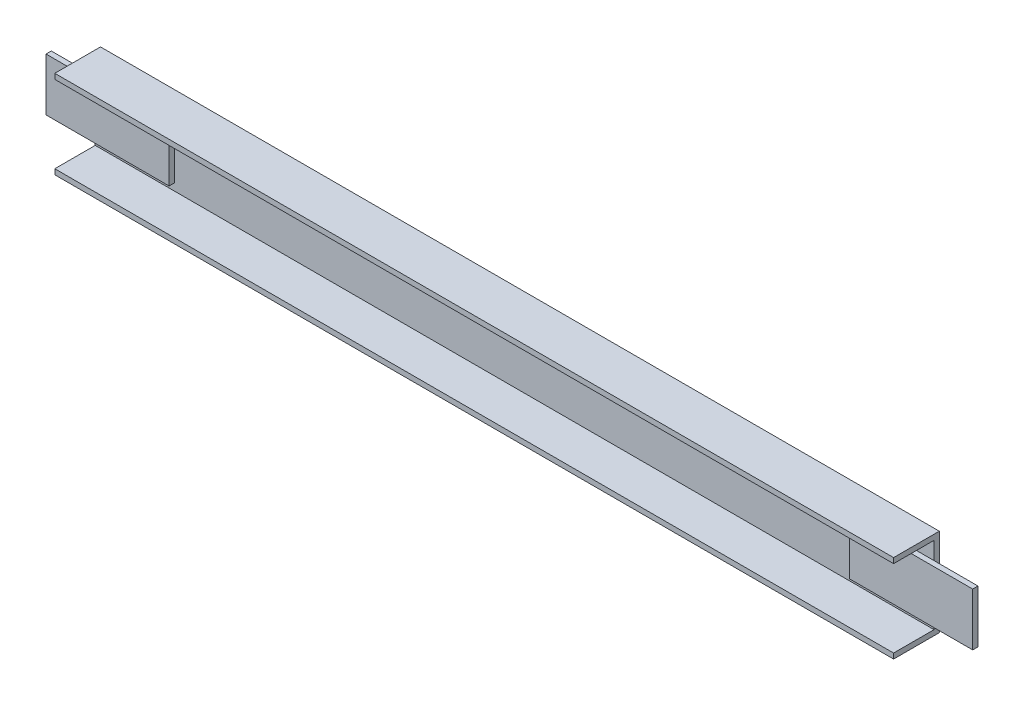
ISO-10303-21;
HEADER;
FILE_DESCRIPTION(('STEP AP214'),'2;1');
FILE_NAME('part.step','',(''),(''),'','','');
FILE_SCHEMA(('AUTOMOTIVE_DESIGN { 1 0 10303 214 1 1 1 1 }'));
ENDSEC;
DATA;
#1=APPLICATION_CONTEXT('core data for automotive mechanical design processes');
#2=APPLICATION_PROTOCOL_DEFINITION('international standard','automotive_design',2000,#1);
#3=PRODUCT_CONTEXT('',#1,'mechanical');
#4=PRODUCT('Part','Part','',(#3));
#5=PRODUCT_RELATED_PRODUCT_CATEGORY('part','',(#4));
#6=PRODUCT_DEFINITION_FORMATION('','',#4);
#7=PRODUCT_DEFINITION_CONTEXT('part definition',#1,'design');
#8=PRODUCT_DEFINITION('design','',#6,#7);
#9=PRODUCT_DEFINITION_SHAPE('','',#8);
#10=(LENGTH_UNIT() NAMED_UNIT(*) SI_UNIT(.MILLI.,.METRE.));
#11=(NAMED_UNIT(*) PLANE_ANGLE_UNIT() SI_UNIT($,.RADIAN.));
#12=(NAMED_UNIT(*) SI_UNIT($,.STERADIAN.) SOLID_ANGLE_UNIT());
#13=UNCERTAINTY_MEASURE_WITH_UNIT(LENGTH_MEASURE(1.E-05),#10,'distance_accuracy_value','');
#14=(GEOMETRIC_REPRESENTATION_CONTEXT(3) GLOBAL_UNCERTAINTY_ASSIGNED_CONTEXT((#13)) GLOBAL_UNIT_ASSIGNED_CONTEXT((#10,
#11,#12)) REPRESENTATION_CONTEXT('',''));
#15=CARTESIAN_POINT('',(0.,0.,0.));
#16=DIRECTION('',(0.,0.,1.));
#17=DIRECTION('',(1.,0.,0.));
#18=AXIS2_PLACEMENT_3D('',#15,#16,#17);
#19=CARTESIAN_POINT('',(0.,0.,488.000005483627));
#20=DIRECTION('',(0.,0.,1.));
#21=DIRECTION('',(1.,0.,0.));
#22=AXIS2_PLACEMENT_3D('',#19,#20,#21);
#23=PLANE('',#22);
#24=DIRECTION('',(0.,-1.,0.));
#25=VECTOR('',#24,1.);
#26=CARTESIAN_POINT('',(-61.0000006854534,170.000001788139,488.000005483627));
#27=LINE('',#26,#25);
#28=CARTESIAN_POINT('',(-61.0000006854534,170.000001788139,488.000005483627));
#29=VERTEX_POINT('',#28);
#30=CARTESIAN_POINT('',(-61.0000006854534,119.999997317791,488.000005483627));
#31=VERTEX_POINT('',#30);
#32=EDGE_CURVE('E271',#29,#31,#27,.T.);
#33=ORIENTED_EDGE('',*,*,#32,.F.);
#34=DIRECTION('',(-1.,0.,0.));
#35=VECTOR('',#34,1.);
#36=CARTESIAN_POINT('',(416.000008583069,170.000001788139,488.000005483627));
#37=LINE('',#36,#35);
#38=CARTESIAN_POINT('',(416.000008583069,170.000001788139,488.000005483627));
#39=VERTEX_POINT('',#38);
#40=EDGE_CURVE('E281',#39,#29,#37,.T.);
#41=ORIENTED_EDGE('',*,*,#40,.F.);
#42=DIRECTION('',(0.,1.,0.));
#43=VECTOR('',#42,1.);
#44=CARTESIAN_POINT('',(416.000008583069,119.999997317791,488.000005483627));
#45=LINE('',#44,#43);
#46=CARTESIAN_POINT('',(416.000008583069,119.999997317791,488.000005483627));
#47=VERTEX_POINT('',#46);
#48=EDGE_CURVE('E278',#47,#39,#45,.T.);
#49=ORIENTED_EDGE('',*,*,#48,.F.);
#50=DIRECTION('',(1.,0.,0.));
#51=VECTOR('',#50,1.);
#52=CARTESIAN_POINT('',(-61.0000006854534,119.999997317791,488.000005483627));
#53=LINE('',#52,#51);
#54=EDGE_CURVE('E274',#31,#47,#53,.T.);
#55=ORIENTED_EDGE('',*,*,#54,.F.);
#56=EDGE_LOOP('',(#33,#41,#49,#55));
#57=FACE_BOUND('',#56,.T.);
#58=DIRECTION('',(1.,0.,0.));
#59=VECTOR('',#58,1.);
#60=CARTESIAN_POINT('',(187.5,155.000001192093,488.000005483627));
#61=LINE('',#60,#59);
#62=CARTESIAN_POINT('',(167.500004172325,155.000001192093,488.000005483627));
#63=VERTEX_POINT('',#62);
#64=CARTESIAN_POINT('',(187.5,155.000001192093,488.000005483627));
#65=VERTEX_POINT('',#64);
#66=EDGE_CURVE('E213',#63,#65,#61,.T.);
#67=ORIENTED_EDGE('',*,*,#66,.F.);
#68=DIRECTION('',(0.,1.,0.));
#69=VECTOR('',#68,1.);
#70=CARTESIAN_POINT('',(167.500004172325,155.000001192093,488.000005483627));
#71=LINE('',#70,#69);
#72=CARTESIAN_POINT('',(167.500004172325,135.000005364418,488.000005483627));
#73=VERTEX_POINT('',#72);
#74=EDGE_CURVE('E128',#73,#63,#71,.T.);
#75=ORIENTED_EDGE('',*,*,#74,.F.);
#76=DIRECTION('',(-1.,0.,0.));
#77=VECTOR('',#76,1.);
#78=CARTESIAN_POINT('',(167.500004172325,135.000005364418,488.000005483627));
#79=LINE('',#78,#77);
#80=CARTESIAN_POINT('',(187.5,135.000005364418,488.000005483627));
#81=VERTEX_POINT('',#80);
#82=EDGE_CURVE('E649',#81,#73,#79,.T.);
#83=ORIENTED_EDGE('',*,*,#82,.F.);
#84=DIRECTION('',(0.,-1.,0.));
#85=VECTOR('',#84,1.);
#86=CARTESIAN_POINT('',(187.5,135.000005364418,488.000005483627));
#87=LINE('',#86,#85);
#88=EDGE_CURVE('E57',#65,#81,#87,.T.);
#89=ORIENTED_EDGE('',*,*,#88,.F.);
#90=EDGE_LOOP('',(#67,#75,#83,#89));
#91=FACE_BOUND('',#90,.T.);
#92=ADVANCED_FACE('F38',(#57,#91),#23,.F.);
#93=CARTESIAN_POINT('',(416.000008583069,166.999995708466,490.99999666214));
#94=DIRECTION('',(0.,0.,-1.));
#95=DIRECTION('',(-1.,0.,0.));
#96=AXIS2_PLACEMENT_3D('',#93,#94,#95);
#97=PLANE('',#96);
#98=DIRECTION('',(1.,0.,0.));
#99=VECTOR('',#98,1.);
#100=CARTESIAN_POINT('',(416.000008583069,126.999995231628,490.99999666214));
#101=LINE('',#100,#99);
#102=CARTESIAN_POINT('',(-61.0000006854534,126.999995231628,490.99999666214));
#103=VERTEX_POINT('',#102);
#104=CARTESIAN_POINT('',(-16.0000007599592,126.999995231628,490.99999666214));
#105=VERTEX_POINT('',#104);
#106=EDGE_CURVE('E42',#103,#105,#101,.T.);
#107=ORIENTED_EDGE('',*,*,#106,.F.);
#108=DIRECTION('',(0.,-1.,0.));
#109=VECTOR('',#108,1.);
#110=CARTESIAN_POINT('',(-61.0000006854534,166.999995708466,490.99999666214));
#111=LINE('',#110,#109);
#112=CARTESIAN_POINT('',(-61.0000006854534,123.000003397465,490.99999666214));
#113=VERTEX_POINT('',#112);
#114=EDGE_CURVE('E257',#103,#113,#111,.T.);
#115=ORIENTED_EDGE('',*,*,#114,.T.);
#116=DIRECTION('',(-1.,0.,0.));
#117=VECTOR('',#116,1.);
#118=CARTESIAN_POINT('',(416.000008583069,123.000003397465,490.99999666214));
#119=LINE('',#118,#117);
#120=CARTESIAN_POINT('',(416.000008583069,123.000003397465,490.99999666214));
#121=VERTEX_POINT('',#120);
#122=EDGE_CURVE('E261',#121,#113,#119,.T.);
#123=ORIENTED_EDGE('',*,*,#122,.F.);
#124=DIRECTION('',(0.,-1.,0.));
#125=VECTOR('',#124,1.);
#126=CARTESIAN_POINT('',(416.000008583069,166.999995708466,490.99999666214));
#127=LINE('',#126,#125);
#128=CARTESIAN_POINT('',(416.000008583069,126.999995231628,490.99999666214));
#129=VERTEX_POINT('',#128);
#130=EDGE_CURVE('E245',#129,#121,#127,.T.);
#131=ORIENTED_EDGE('',*,*,#130,.F.);
#132=DIRECTION('',(1.,0.,0.));
#133=VECTOR('',#132,1.);
#134=CARTESIAN_POINT('',(416.000008583069,126.999995231628,490.99999666214));
#135=LINE('',#134,#133);
#136=CARTESIAN_POINT('',(370.999991893768,126.999995231628,490.99999666214));
#137=VERTEX_POINT('',#136);
#138=EDGE_CURVE('E311',#137,#129,#135,.T.);
#139=ORIENTED_EDGE('',*,*,#138,.F.);
#140=DIRECTION('',(0.,-1.,0.));
#141=VECTOR('',#140,1.);
#142=CARTESIAN_POINT('',(370.999991893768,129.999995231628,490.99999666214));
#143=LINE('',#142,#141);
#144=CARTESIAN_POINT('',(370.999991893768,156.999996423721,490.99999666214));
#145=VERTEX_POINT('',#144);
#146=EDGE_CURVE('E233',#145,#137,#143,.T.);
#147=ORIENTED_EDGE('',*,*,#146,.F.);
#148=DIRECTION('',(-1.,0.,0.));
#149=VECTOR('',#148,1.);
#150=CARTESIAN_POINT('',(416.000008583069,156.999996423721,490.99999666214));
#151=LINE('',#150,#149);
#152=CARTESIAN_POINT('',(416.000008583069,156.999996423721,490.99999666214));
#153=VERTEX_POINT('',#152);
#154=EDGE_CURVE('E12',#153,#145,#151,.T.);
#155=ORIENTED_EDGE('',*,*,#154,.F.);
#156=CARTESIAN_POINT('',(416.000008583069,166.999995708466,490.99999666214));
#157=VERTEX_POINT('',#156);
#158=EDGE_CURVE('E246',#157,#153,#127,.T.);
#159=ORIENTED_EDGE('',*,*,#158,.F.);
#160=DIRECTION('',(-1.,0.,0.));
#161=VECTOR('',#160,1.);
#162=CARTESIAN_POINT('',(416.000008583069,166.999995708466,490.99999666214));
#163=LINE('',#162,#161);
#164=CARTESIAN_POINT('',(-61.0000006854534,166.999995708466,490.99999666214));
#165=VERTEX_POINT('',#164);
#166=EDGE_CURVE('E265',#157,#165,#163,.T.);
#167=ORIENTED_EDGE('',*,*,#166,.T.);
#168=CARTESIAN_POINT('',(-61.0000006854534,156.999996423721,490.99999666214));
#169=VERTEX_POINT('',#168);
#170=EDGE_CURVE('E242',#165,#169,#111,.T.);
#171=ORIENTED_EDGE('',*,*,#170,.T.);
#172=DIRECTION('',(-1.,0.,0.));
#173=VECTOR('',#172,1.);
#174=CARTESIAN_POINT('',(416.000008583069,156.999996423721,490.99999666214));
#175=LINE('',#174,#173);
#176=CARTESIAN_POINT('',(-16.0000007599592,156.999996423721,490.99999666214));
#177=VERTEX_POINT('',#176);
#178=EDGE_CURVE('E308',#177,#169,#175,.T.);
#179=ORIENTED_EDGE('',*,*,#178,.F.);
#180=DIRECTION('',(0.,1.,0.));
#181=VECTOR('',#180,1.);
#182=CARTESIAN_POINT('',(-16.0000007599592,159.999996423721,490.99999666214));
#183=LINE('',#182,#181);
#184=EDGE_CURVE('E124',#105,#177,#183,.T.);
#185=ORIENTED_EDGE('',*,*,#184,.F.);
#186=EDGE_LOOP('',(#107,#115,#123,#131,#139,#147,#155,#159,#167,#171,#179,#185));
#187=FACE_BOUND('',#186,.T.);
#188=ADVANCED_FACE('F357',(#187),#97,.F.);
#189=CARTESIAN_POINT('',(0.,0.,513.999998569489));
#190=DIRECTION('',(0.,0.,1.));
#191=DIRECTION('',(1.,0.,0.));
#192=AXIS2_PLACEMENT_3D('',#189,#190,#191);
#193=PLANE('',#192);
#194=DIRECTION('',(-1.,0.,0.));
#195=VECTOR('',#194,1.);
#196=CARTESIAN_POINT('',(416.000008583069,123.000003397465,513.999998569489));
#197=LINE('',#196,#195);
#198=CARTESIAN_POINT('',(416.000008583069,123.000003397465,513.999998569489));
#199=VERTEX_POINT('',#198);
#200=CARTESIAN_POINT('',(-61.0000006854534,123.000003397465,513.999998569489));
#201=VERTEX_POINT('',#200);
#202=EDGE_CURVE('E249',#199,#201,#197,.T.);
#203=ORIENTED_EDGE('',*,*,#202,.T.);
#204=DIRECTION('',(0.,-1.,0.));
#205=VECTOR('',#204,1.);
#206=CARTESIAN_POINT('',(-61.0000006854534,170.000001788139,513.999998569489));
#207=LINE('',#206,#205);
#208=CARTESIAN_POINT('',(-61.0000006854534,119.999997317791,513.999998569489));
#209=VERTEX_POINT('',#208);
#210=EDGE_CURVE('E264',#201,#209,#207,.T.);
#211=ORIENTED_EDGE('',*,*,#210,.T.);
#212=DIRECTION('',(1.,0.,0.));
#213=VECTOR('',#212,1.);
#214=CARTESIAN_POINT('',(-61.0000006854534,119.999997317791,513.999998569489));
#215=LINE('',#214,#213);
#216=CARTESIAN_POINT('',(416.000008583069,119.999997317791,513.999998569489));
#217=VERTEX_POINT('',#216);
#218=EDGE_CURVE('E288',#209,#217,#215,.T.);
#219=ORIENTED_EDGE('',*,*,#218,.T.);
#220=DIRECTION('',(0.,1.,0.));
#221=VECTOR('',#220,1.);
#222=CARTESIAN_POINT('',(416.000008583069,119.999997317791,513.999998569489));
#223=LINE('',#222,#221);
#224=EDGE_CURVE('E292',#217,#199,#223,.T.);
#225=ORIENTED_EDGE('',*,*,#224,.T.);
#226=EDGE_LOOP('',(#203,#211,#219,#225));
#227=FACE_BOUND('',#226,.T.);
#228=ADVANCED_FACE('F391',(#227),#193,.T.);
#229=CARTESIAN_POINT('',(-61.0000006854534,170.000001788139,488.000005483627));
#230=DIRECTION('',(-1.,0.,0.));
#231=DIRECTION('',(0.,0.,1.));
#232=AXIS2_PLACEMENT_3D('',#229,#230,#231);
#233=PLANE('',#232);
#234=DIRECTION('',(0.,0.,1.));
#235=VECTOR('',#234,1.);
#236=CARTESIAN_POINT('',(-61.0000006854534,123.000003397465,490.99999666214));
#237=LINE('',#236,#235);
#238=EDGE_CURVE('E251',#113,#201,#237,.T.);
#239=ORIENTED_EDGE('',*,*,#238,.F.);
#240=ORIENTED_EDGE('',*,*,#114,.F.);
#241=EDGE_CURVE('E260',#169,#103,#111,.T.);
#242=ORIENTED_EDGE('',*,*,#241,.F.);
#243=ORIENTED_EDGE('',*,*,#170,.F.);
#244=DIRECTION('',(0.,0.,-1.));
#245=VECTOR('',#244,1.);
#246=CARTESIAN_POINT('',(-61.0000006854534,166.999995708466,513.999998569489));
#247=LINE('',#246,#245);
#248=CARTESIAN_POINT('',(-61.0000006854534,166.999995708466,513.999998569489));
#249=VERTEX_POINT('',#248);
#250=EDGE_CURVE('E253',#249,#165,#247,.T.);
#251=ORIENTED_EDGE('',*,*,#250,.F.);
#252=CARTESIAN_POINT('',(-61.0000006854534,170.000001788139,513.999998569489));
#253=VERTEX_POINT('',#252);
#254=EDGE_CURVE('E285',#253,#249,#207,.T.);
#255=ORIENTED_EDGE('',*,*,#254,.F.);
#256=DIRECTION('',(0.,0.,1.));
#257=VECTOR('',#256,1.);
#258=CARTESIAN_POINT('',(-61.0000006854534,170.000001788139,488.000005483627));
#259=LINE('',#258,#257);
#260=EDGE_CURVE('E48',#29,#253,#259,.T.);
#261=ORIENTED_EDGE('',*,*,#260,.F.);
#262=ORIENTED_EDGE('',*,*,#32,.T.);
#263=DIRECTION('',(0.,0.,1.));
#264=VECTOR('',#263,1.);
#265=CARTESIAN_POINT('',(-61.0000006854534,119.999997317791,488.000005483627));
#266=LINE('',#265,#264);
#267=EDGE_CURVE('E284',#31,#209,#266,.T.);
#268=ORIENTED_EDGE('',*,*,#267,.T.);
#269=ORIENTED_EDGE('',*,*,#210,.F.);
#270=EDGE_LOOP('',(#239,#240,#242,#243,#251,#255,#261,#262,#268,#269));
#271=FACE_BOUND('',#270,.T.);
#272=ADVANCED_FACE('F367',(#271),#233,.T.);
#273=CARTESIAN_POINT('',(416.000008583069,170.000001788139,488.000005483627));
#274=DIRECTION('',(0.,1.,0.));
#275=DIRECTION('',(0.,0.,1.));
#276=AXIS2_PLACEMENT_3D('',#273,#274,#275);
#277=PLANE('',#276);
#278=DIRECTION('',(-1.,0.,0.));
#279=VECTOR('',#278,1.);
#280=CARTESIAN_POINT('',(416.000008583069,170.000001788139,513.999998569489));
#281=LINE('',#280,#279);
#282=CARTESIAN_POINT('',(416.000008583069,170.000001788139,513.999998569489));
#283=VERTEX_POINT('',#282);
#284=EDGE_CURVE('E275',#283,#253,#281,.T.);
#285=ORIENTED_EDGE('',*,*,#284,.F.);
#286=DIRECTION('',(0.,0.,1.));
#287=VECTOR('',#286,1.);
#288=CARTESIAN_POINT('',(416.000008583069,170.000001788139,488.000005483627));
#289=LINE('',#288,#287);
#290=EDGE_CURVE('E298',#39,#283,#289,.T.);
#291=ORIENTED_EDGE('',*,*,#290,.F.);
#292=ORIENTED_EDGE('',*,*,#40,.T.);
#293=ORIENTED_EDGE('',*,*,#260,.T.);
#294=EDGE_LOOP('',(#285,#291,#292,#293));
#295=FACE_BOUND('',#294,.T.);
#296=ADVANCED_FACE('F379',(#295),#277,.T.);
#297=CARTESIAN_POINT('',(416.000008583069,119.999997317791,488.000005483627));
#298=DIRECTION('',(1.,0.,0.));
#299=DIRECTION('',(0.,0.,-1.));
#300=AXIS2_PLACEMENT_3D('',#297,#298,#299);
#301=PLANE('',#300);
#302=DIRECTION('',(0.,0.,1.));
#303=VECTOR('',#302,1.);
#304=CARTESIAN_POINT('',(416.000008583069,123.000003397465,490.99999666214));
#305=LINE('',#304,#303);
#306=EDGE_CURVE('E238',#121,#199,#305,.T.);
#307=ORIENTED_EDGE('',*,*,#306,.T.);
#308=ORIENTED_EDGE('',*,*,#224,.F.);
#309=DIRECTION('',(0.,0.,1.));
#310=VECTOR('',#309,1.);
#311=CARTESIAN_POINT('',(416.000008583069,119.999997317791,488.000005483627));
#312=LINE('',#311,#310);
#313=EDGE_CURVE('E301',#47,#217,#312,.T.);
#314=ORIENTED_EDGE('',*,*,#313,.F.);
#315=ORIENTED_EDGE('',*,*,#48,.T.);
#316=ORIENTED_EDGE('',*,*,#290,.T.);
#317=CARTESIAN_POINT('',(416.000008583069,166.999995708466,513.999998569489));
#318=VERTEX_POINT('',#317);
#319=EDGE_CURVE('E291',#318,#283,#223,.T.);
#320=ORIENTED_EDGE('',*,*,#319,.F.);
#321=DIRECTION('',(0.,0.,-1.));
#322=VECTOR('',#321,1.);
#323=CARTESIAN_POINT('',(416.000008583069,166.999995708466,513.999998569489));
#324=LINE('',#323,#322);
#325=EDGE_CURVE('E241',#318,#157,#324,.T.);
#326=ORIENTED_EDGE('',*,*,#325,.T.);
#327=ORIENTED_EDGE('',*,*,#158,.T.);
#328=EDGE_CURVE('E250',#153,#129,#127,.T.);
#329=ORIENTED_EDGE('',*,*,#328,.T.);
#330=ORIENTED_EDGE('',*,*,#130,.T.);
#331=EDGE_LOOP('',(#307,#308,#314,#315,#316,#320,#326,#327,#329,#330));
#332=FACE_BOUND('',#331,.T.);
#333=ADVANCED_FACE('F396',(#332),#301,.T.);
#334=CARTESIAN_POINT('',(-61.0000006854534,119.999997317791,488.000005483627));
#335=DIRECTION('',(0.,-1.,0.));
#336=DIRECTION('',(0.,0.,-1.));
#337=AXIS2_PLACEMENT_3D('',#334,#335,#336);
#338=PLANE('',#337);
#339=ORIENTED_EDGE('',*,*,#218,.F.);
#340=ORIENTED_EDGE('',*,*,#267,.F.);
#341=ORIENTED_EDGE('',*,*,#54,.T.);
#342=ORIENTED_EDGE('',*,*,#313,.T.);
#343=EDGE_LOOP('',(#339,#340,#341,#342));
#344=FACE_BOUND('',#343,.T.);
#345=ADVANCED_FACE('F387',(#344),#338,.T.);
#346=DIRECTION('',(-1.,0.,0.));
#347=VECTOR('',#346,1.);
#348=CARTESIAN_POINT('',(416.000008583069,166.999995708466,513.999998569489));
#349=LINE('',#348,#347);
#350=EDGE_CURVE('E267',#318,#249,#349,.T.);
#351=ORIENTED_EDGE('',*,*,#350,.F.);
#352=ORIENTED_EDGE('',*,*,#319,.T.);
#353=ORIENTED_EDGE('',*,*,#284,.T.);
#354=ORIENTED_EDGE('',*,*,#254,.T.);
#355=EDGE_LOOP('',(#351,#352,#353,#354));
#356=FACE_BOUND('',#355,.T.);
#357=ADVANCED_FACE('F375',(#356),#193,.T.);
#358=CARTESIAN_POINT('',(416.000008583069,123.000003397465,490.99999666214));
#359=DIRECTION('',(0.,-1.,0.));
#360=DIRECTION('',(0.,0.,-1.));
#361=AXIS2_PLACEMENT_3D('',#358,#359,#360);
#362=PLANE('',#361);
#363=ORIENTED_EDGE('',*,*,#238,.T.);
#364=ORIENTED_EDGE('',*,*,#202,.F.);
#365=ORIENTED_EDGE('',*,*,#306,.F.);
#366=ORIENTED_EDGE('',*,*,#122,.T.);
#367=EDGE_LOOP('',(#363,#364,#365,#366));
#368=FACE_BOUND('',#367,.T.);
#369=ADVANCED_FACE('F394',(#368),#362,.F.);
#370=CARTESIAN_POINT('',(416.000008583069,166.999995708466,513.999998569489));
#371=DIRECTION('',(0.,1.,0.));
#372=DIRECTION('',(0.,0.,1.));
#373=AXIS2_PLACEMENT_3D('',#370,#371,#372);
#374=PLANE('',#373);
#375=ORIENTED_EDGE('',*,*,#250,.T.);
#376=ORIENTED_EDGE('',*,*,#166,.F.);
#377=ORIENTED_EDGE('',*,*,#325,.F.);
#378=ORIENTED_EDGE('',*,*,#350,.T.);
#379=EDGE_LOOP('',(#375,#376,#377,#378));
#380=FACE_BOUND('',#379,.T.);
#381=ADVANCED_FACE('F371',(#380),#374,.F.);
#382=CARTESIAN_POINT('',(470.999985933304,126.999995231628,493.999987840652));
#383=DIRECTION('',(0.,1.,0.));
#384=DIRECTION('',(0.,0.,1.));
#385=AXIS2_PLACEMENT_3D('',#382,#383,#384);
#386=PLANE('',#385);
#387=ORIENTED_EDGE('',*,*,#138,.T.);
#388=DIRECTION('',(1.,0.,0.));
#389=VECTOR('',#388,1.);
#390=CARTESIAN_POINT('',(0.,126.999995231628,490.99999666214));
#391=LINE('',#390,#389);
#392=CARTESIAN_POINT('',(440.999985933304,126.999995231628,490.99999666214));
#393=VERTEX_POINT('',#392);
#394=EDGE_CURVE('E336',#129,#393,#391,.T.);
#395=ORIENTED_EDGE('',*,*,#394,.T.);
#396=DIRECTION('',(0.,0.,-1.));
#397=VECTOR('',#396,1.);
#398=CARTESIAN_POINT('',(440.999985933304,126.999995231628,493.999987840652));
#399=LINE('',#398,#397);
#400=CARTESIAN_POINT('',(440.999985933304,126.999995231628,493.999987840652));
#401=VERTEX_POINT('',#400);
#402=EDGE_CURVE('E254',#401,#393,#399,.T.);
#403=ORIENTED_EDGE('',*,*,#402,.F.);
#404=DIRECTION('',(1.,0.,0.));
#405=VECTOR('',#404,1.);
#406=CARTESIAN_POINT('',(0.,126.999995231628,493.999987840652));
#407=LINE('',#406,#405);
#408=CARTESIAN_POINT('',(370.999991893768,126.999995231628,493.999987840652));
#409=VERTEX_POINT('',#408);
#410=EDGE_CURVE('E236',#409,#401,#407,.T.);
#411=ORIENTED_EDGE('',*,*,#410,.F.);
#412=DIRECTION('',(0.,0.,-1.));
#413=VECTOR('',#412,1.);
#414=CARTESIAN_POINT('',(370.999991893768,126.999995231628,493.999987840652));
#415=LINE('',#414,#413);
#416=EDGE_CURVE('E231',#409,#137,#415,.T.);
#417=ORIENTED_EDGE('',*,*,#416,.T.);
#418=EDGE_LOOP('',(#387,#395,#403,#411,#417));
#419=FACE_BOUND('',#418,.T.);
#420=ADVANCED_FACE('F407',(#419),#386,.F.);
#421=CARTESIAN_POINT('',(440.999985933304,159.999996423721,493.999987840652));
#422=DIRECTION('',(-1.,0.,0.));
#423=DIRECTION('',(0.,0.,1.));
#424=AXIS2_PLACEMENT_3D('',#421,#422,#423);
#425=PLANE('',#424);
#426=DIRECTION('',(0.,1.,0.));
#427=VECTOR('',#426,1.);
#428=CARTESIAN_POINT('',(440.999985933304,0.,490.99999666214));
#429=LINE('',#428,#427);
#430=CARTESIAN_POINT('',(440.999985933304,156.999996423721,490.99999666214));
#431=VERTEX_POINT('',#430);
#432=EDGE_CURVE('E309',#393,#431,#429,.T.);
#433=ORIENTED_EDGE('',*,*,#432,.T.);
#434=DIRECTION('',(0.,0.,-1.));
#435=VECTOR('',#434,1.);
#436=CARTESIAN_POINT('',(440.999985933304,156.999996423721,493.999987840652));
#437=LINE('',#436,#435);
#438=CARTESIAN_POINT('',(440.999985933304,156.999996423721,493.999987840652));
#439=VERTEX_POINT('',#438);
#440=EDGE_CURVE('E327',#439,#431,#437,.T.);
#441=ORIENTED_EDGE('',*,*,#440,.F.);
#442=DIRECTION('',(0.,1.,0.));
#443=VECTOR('',#442,1.);
#444=CARTESIAN_POINT('',(440.999985933304,0.,493.999987840652));
#445=LINE('',#444,#443);
#446=EDGE_CURVE('E312',#401,#439,#445,.T.);
#447=ORIENTED_EDGE('',*,*,#446,.F.);
#448=ORIENTED_EDGE('',*,*,#402,.T.);
#449=EDGE_LOOP('',(#433,#441,#447,#448));
#450=FACE_BOUND('',#449,.T.);
#451=ADVANCED_FACE('F420',(#450),#425,.F.);
#452=CARTESIAN_POINT('',(370.999991893768,156.999996423721,493.999987840652));
#453=DIRECTION('',(0.,-1.,0.));
#454=DIRECTION('',(0.,0.,-1.));
#455=AXIS2_PLACEMENT_3D('',#452,#453,#454);
#456=PLANE('',#455);
#457=DIRECTION('',(-1.,0.,0.));
#458=VECTOR('',#457,1.);
#459=CARTESIAN_POINT('',(0.,156.999996423721,490.99999666214));
#460=LINE('',#459,#458);
#461=EDGE_CURVE('E237',#431,#153,#460,.T.);
#462=ORIENTED_EDGE('',*,*,#461,.T.);
#463=ORIENTED_EDGE('',*,*,#154,.T.);
#464=DIRECTION('',(0.,0.,-1.));
#465=VECTOR('',#464,1.);
#466=CARTESIAN_POINT('',(370.999991893768,156.999996423721,493.999987840652));
#467=LINE('',#466,#465);
#468=CARTESIAN_POINT('',(370.999991893768,156.999996423721,493.999987840652));
#469=VERTEX_POINT('',#468);
#470=EDGE_CURVE('E330',#469,#145,#467,.T.);
#471=ORIENTED_EDGE('',*,*,#470,.F.);
#472=DIRECTION('',(-1.,0.,0.));
#473=VECTOR('',#472,1.);
#474=CARTESIAN_POINT('',(0.,156.999996423721,493.999987840652));
#475=LINE('',#474,#473);
#476=EDGE_CURVE('E232',#439,#469,#475,.T.);
#477=ORIENTED_EDGE('',*,*,#476,.F.);
#478=ORIENTED_EDGE('',*,*,#440,.T.);
#479=EDGE_LOOP('',(#462,#463,#471,#477,#478));
#480=FACE_BOUND('',#479,.T.);
#481=ADVANCED_FACE('F414',(#480),#456,.F.);
#482=CARTESIAN_POINT('',(370.999991893768,129.999995231628,493.999987840652));
#483=DIRECTION('',(1.,0.,0.));
#484=DIRECTION('',(0.,0.,-1.));
#485=AXIS2_PLACEMENT_3D('',#482,#483,#484);
#486=PLANE('',#485);
#487=ORIENTED_EDGE('',*,*,#146,.T.);
#488=ORIENTED_EDGE('',*,*,#416,.F.);
#489=DIRECTION('',(0.,-1.,0.));
#490=VECTOR('',#489,1.);
#491=CARTESIAN_POINT('',(370.999991893768,129.999995231628,493.999987840652));
#492=LINE('',#491,#490);
#493=EDGE_CURVE('E229',#469,#409,#492,.T.);
#494=ORIENTED_EDGE('',*,*,#493,.F.);
#495=ORIENTED_EDGE('',*,*,#470,.T.);
#496=EDGE_LOOP('',(#487,#488,#494,#495));
#497=FACE_BOUND('',#496,.T.);
#498=ADVANCED_FACE('F403',(#497),#486,.F.);
#499=CARTESIAN_POINT('',(0.,0.,493.999987840652));
#500=DIRECTION('',(0.,0.,-1.));
#501=DIRECTION('',(-1.,0.,0.));
#502=AXIS2_PLACEMENT_3D('',#499,#500,#501);
#503=PLANE('',#502);
#504=ORIENTED_EDGE('',*,*,#410,.T.);
#505=ORIENTED_EDGE('',*,*,#446,.T.);
#506=ORIENTED_EDGE('',*,*,#476,.T.);
#507=ORIENTED_EDGE('',*,*,#493,.T.);
#508=EDGE_LOOP('',(#504,#505,#506,#507));
#509=FACE_BOUND('',#508,.T.);
#510=ADVANCED_FACE('F410',(#509),#503,.F.);
#511=CARTESIAN_POINT('',(0.,0.,490.99999666214));
#512=DIRECTION('',(0.,0.,-1.));
#513=DIRECTION('',(-1.,0.,0.));
#514=AXIS2_PLACEMENT_3D('',#511,#512,#513);
#515=PLANE('',#514);
#516=ORIENTED_EDGE('',*,*,#394,.F.);
#517=ORIENTED_EDGE('',*,*,#328,.F.);
#518=ORIENTED_EDGE('',*,*,#461,.F.);
#519=ORIENTED_EDGE('',*,*,#432,.F.);
#520=EDGE_LOOP('',(#516,#517,#518,#519));
#521=FACE_BOUND('',#520,.T.);
#522=ADVANCED_FACE('F417',(#521),#515,.T.);
#523=CARTESIAN_POINT('',(-85.9999966621399,129.999995231628,493.999987840652));
#524=DIRECTION('',(1.,0.,0.));
#525=DIRECTION('',(0.,0.,-1.));
#526=AXIS2_PLACEMENT_3D('',#523,#524,#525);
#527=PLANE('',#526);
#528=DIRECTION('',(0.,-1.,0.));
#529=VECTOR('',#528,1.);
#530=CARTESIAN_POINT('',(-85.9999966621399,0.,490.99999666214));
#531=LINE('',#530,#529);
#532=CARTESIAN_POINT('',(-85.9999966621399,156.999996423721,490.99999666214));
#533=VERTEX_POINT('',#532);
#534=CARTESIAN_POINT('',(-85.9999966621399,126.999995231628,490.99999666214));
#535=VERTEX_POINT('',#534);
#536=EDGE_CURVE('E214',#533,#535,#531,.T.);
#537=ORIENTED_EDGE('',*,*,#536,.T.);
#538=DIRECTION('',(0.,0.,-1.));
#539=VECTOR('',#538,1.);
#540=CARTESIAN_POINT('',(-85.9999966621399,126.999995231628,493.999987840652));
#541=LINE('',#540,#539);
#542=CARTESIAN_POINT('',(-85.9999966621399,126.999995231628,493.999987840652));
#543=VERTEX_POINT('',#542);
#544=EDGE_CURVE('E344',#543,#535,#541,.T.);
#545=ORIENTED_EDGE('',*,*,#544,.F.);
#546=DIRECTION('',(0.,-1.,0.));
#547=VECTOR('',#546,1.);
#548=CARTESIAN_POINT('',(-85.9999966621399,0.,493.999987840652));
#549=LINE('',#548,#547);
#550=CARTESIAN_POINT('',(-85.9999966621399,156.999996423721,493.999987840652));
#551=VERTEX_POINT('',#550);
#552=EDGE_CURVE('E305',#551,#543,#549,.T.);
#553=ORIENTED_EDGE('',*,*,#552,.F.);
#554=DIRECTION('',(0.,0.,-1.));
#555=VECTOR('',#554,1.);
#556=CARTESIAN_POINT('',(-85.9999966621399,156.999996423721,493.999987840652));
#557=LINE('',#556,#555);
#558=EDGE_CURVE('E320',#551,#533,#557,.T.);
#559=ORIENTED_EDGE('',*,*,#558,.T.);
#560=EDGE_LOOP('',(#537,#545,#553,#559));
#561=FACE_BOUND('',#560,.T.);
#562=ADVANCED_FACE('F448',(#561),#527,.F.);
#563=CARTESIAN_POINT('',(-16.0000007599592,126.999995231628,493.999987840652));
#564=DIRECTION('',(0.,1.,0.));
#565=DIRECTION('',(0.,0.,1.));
#566=AXIS2_PLACEMENT_3D('',#563,#564,#565);
#567=PLANE('',#566);
#568=DIRECTION('',(1.,0.,0.));
#569=VECTOR('',#568,1.);
#570=CARTESIAN_POINT('',(0.,126.999995231628,490.99999666214));
#571=LINE('',#570,#569);
#572=EDGE_CURVE('E228',#535,#103,#571,.T.);
#573=ORIENTED_EDGE('',*,*,#572,.T.);
#574=ORIENTED_EDGE('',*,*,#106,.T.);
#575=DIRECTION('',(0.,0.,-1.));
#576=VECTOR('',#575,1.);
#577=CARTESIAN_POINT('',(-16.0000007599592,126.999995231628,493.999987840652));
#578=LINE('',#577,#576);
#579=CARTESIAN_POINT('',(-16.0000007599592,126.999995231628,493.999987840652));
#580=VERTEX_POINT('',#579);
#581=EDGE_CURVE('E319',#580,#105,#578,.T.);
#582=ORIENTED_EDGE('',*,*,#581,.F.);
#583=DIRECTION('',(1.,0.,0.));
#584=VECTOR('',#583,1.);
#585=CARTESIAN_POINT('',(0.,126.999995231628,493.999987840652));
#586=LINE('',#585,#584);
#587=EDGE_CURVE('E225',#543,#580,#586,.T.);
#588=ORIENTED_EDGE('',*,*,#587,.F.);
#589=ORIENTED_EDGE('',*,*,#544,.T.);
#590=EDGE_LOOP('',(#573,#574,#582,#588,#589));
#591=FACE_BOUND('',#590,.T.);
#592=ADVANCED_FACE('F40',(#591),#567,.F.);
#593=CARTESIAN_POINT('',(-16.0000007599592,159.999996423721,493.999987840652));
#594=DIRECTION('',(-1.,0.,0.));
#595=DIRECTION('',(0.,-1.,0.));
#596=AXIS2_PLACEMENT_3D('',#593,#594,#595);
#597=PLANE('',#596);
#598=ORIENTED_EDGE('',*,*,#184,.T.);
#599=DIRECTION('',(0.,0.,-1.));
#600=VECTOR('',#599,1.);
#601=CARTESIAN_POINT('',(-16.0000007599592,156.999996423721,493.999987840652));
#602=LINE('',#601,#600);
#603=CARTESIAN_POINT('',(-16.0000007599592,156.999996423721,493.999987840652));
#604=VERTEX_POINT('',#603);
#605=EDGE_CURVE('E316',#604,#177,#602,.T.);
#606=ORIENTED_EDGE('',*,*,#605,.F.);
#607=DIRECTION('',(0.,1.,0.));
#608=VECTOR('',#607,1.);
#609=CARTESIAN_POINT('',(-16.0000007599592,159.999996423721,493.999987840652));
#610=LINE('',#609,#608);
#611=EDGE_CURVE('E222',#580,#604,#610,.T.);
#612=ORIENTED_EDGE('',*,*,#611,.F.);
#613=ORIENTED_EDGE('',*,*,#581,.T.);
#614=EDGE_LOOP('',(#598,#606,#612,#613));
#615=FACE_BOUND('',#614,.T.);
#616=ADVANCED_FACE('F353',(#615),#597,.F.);
#617=CARTESIAN_POINT('',(-115.99999666214,156.999996423721,493.999987840652));
#618=DIRECTION('',(0.,-1.,0.));
#619=DIRECTION('',(0.,0.,-1.));
#620=AXIS2_PLACEMENT_3D('',#617,#618,#619);
#621=PLANE('',#620);
#622=ORIENTED_EDGE('',*,*,#178,.T.);
#623=DIRECTION('',(-1.,0.,0.));
#624=VECTOR('',#623,1.);
#625=CARTESIAN_POINT('',(0.,156.999996423721,490.99999666214));
#626=LINE('',#625,#624);
#627=EDGE_CURVE('E227',#169,#533,#626,.T.);
#628=ORIENTED_EDGE('',*,*,#627,.T.);
#629=ORIENTED_EDGE('',*,*,#558,.F.);
#630=DIRECTION('',(-1.,0.,0.));
#631=VECTOR('',#630,1.);
#632=CARTESIAN_POINT('',(0.,156.999996423721,493.999987840652));
#633=LINE('',#632,#631);
#634=EDGE_CURVE('E224',#604,#551,#633,.T.);
#635=ORIENTED_EDGE('',*,*,#634,.F.);
#636=ORIENTED_EDGE('',*,*,#605,.T.);
#637=EDGE_LOOP('',(#622,#628,#629,#635,#636));
#638=FACE_BOUND('',#637,.T.);
#639=ADVANCED_FACE('F461',(#638),#621,.F.);
#640=CARTESIAN_POINT('',(0.,0.,493.999987840652));
#641=DIRECTION('',(0.,0.,-1.));
#642=DIRECTION('',(-1.,0.,0.));
#643=AXIS2_PLACEMENT_3D('',#640,#641,#642);
#644=PLANE('',#643);
#645=ORIENTED_EDGE('',*,*,#552,.T.);
#646=ORIENTED_EDGE('',*,*,#587,.T.);
#647=ORIENTED_EDGE('',*,*,#611,.T.);
#648=ORIENTED_EDGE('',*,*,#634,.T.);
#649=EDGE_LOOP('',(#645,#646,#647,#648));
#650=FACE_BOUND('',#649,.T.);
#651=ADVANCED_FACE('F463',(#650),#644,.F.);
#652=CARTESIAN_POINT('',(0.,0.,490.99999666214));
#653=DIRECTION('',(0.,0.,-1.));
#654=DIRECTION('',(-1.,0.,0.));
#655=AXIS2_PLACEMENT_3D('',#652,#653,#654);
#656=PLANE('',#655);
#657=ORIENTED_EDGE('',*,*,#627,.F.);
#658=ORIENTED_EDGE('',*,*,#241,.T.);
#659=ORIENTED_EDGE('',*,*,#572,.F.);
#660=ORIENTED_EDGE('',*,*,#536,.F.);
#661=EDGE_LOOP('',(#657,#658,#659,#660));
#662=FACE_BOUND('',#661,.T.);
#663=ADVANCED_FACE('F362',(#662),#656,.T.);
#664=CARTESIAN_POINT('',(187.5,155.000001192093,477.999985218048));
#665=DIRECTION('',(0.,-1.,0.));
#666=DIRECTION('',(0.,0.,-1.));
#667=AXIS2_PLACEMENT_3D('',#664,#665,#666);
#668=PLANE('',#667);
#669=ORIENTED_EDGE('',*,*,#66,.T.);
#670=DIRECTION('',(0.,0.,1.));
#671=VECTOR('',#670,1.);
#672=CARTESIAN_POINT('',(187.5,155.000001192093,477.999985218048));
#673=LINE('',#672,#671);
#674=CARTESIAN_POINT('',(187.5,155.000001192093,477.999985218048));
#675=VERTEX_POINT('',#674);
#676=EDGE_CURVE('E195',#675,#65,#673,.T.);
#677=ORIENTED_EDGE('',*,*,#676,.F.);
#678=DIRECTION('',(1.,0.,0.));
#679=VECTOR('',#678,1.);
#680=CARTESIAN_POINT('',(187.5,155.000001192093,477.999985218048));
#681=LINE('',#680,#679);
#682=CARTESIAN_POINT('',(167.500004172325,155.000001192093,477.999985218048));
#683=VERTEX_POINT('',#682);
#684=EDGE_CURVE('E202',#683,#675,#681,.T.);
#685=ORIENTED_EDGE('',*,*,#684,.F.);
#686=DIRECTION('',(0.,0.,1.));
#687=VECTOR('',#686,1.);
#688=CARTESIAN_POINT('',(167.500004172325,155.000001192093,477.999985218048));
#689=LINE('',#688,#687);
#690=EDGE_CURVE('E652',#683,#63,#689,.T.);
#691=ORIENTED_EDGE('',*,*,#690,.T.);
#692=EDGE_LOOP('',(#669,#677,#685,#691));
#693=FACE_BOUND('',#692,.T.);
#694=ADVANCED_FACE('F212',(#693),#668,.F.);
#695=CARTESIAN_POINT('',(187.5,135.000005364418,477.999985218048));
#696=DIRECTION('',(-1.,0.,0.));
#697=DIRECTION('',(0.,0.,1.));
#698=AXIS2_PLACEMENT_3D('',#695,#696,#697);
#699=PLANE('',#698);
#700=ORIENTED_EDGE('',*,*,#88,.T.);
#701=DIRECTION('',(0.,0.,1.));
#702=VECTOR('',#701,1.);
#703=CARTESIAN_POINT('',(187.5,135.000005364418,477.999985218048));
#704=LINE('',#703,#702);
#705=CARTESIAN_POINT('',(187.5,135.000005364418,477.999985218048));
#706=VERTEX_POINT('',#705);
#707=EDGE_CURVE('E198',#706,#81,#704,.T.);
#708=ORIENTED_EDGE('',*,*,#707,.F.);
#709=DIRECTION('',(0.,-1.,0.));
#710=VECTOR('',#709,1.);
#711=CARTESIAN_POINT('',(187.5,135.000005364418,477.999985218048));
#712=LINE('',#711,#710);
#713=EDGE_CURVE('E191',#675,#706,#712,.T.);
#714=ORIENTED_EDGE('',*,*,#713,.F.);
#715=ORIENTED_EDGE('',*,*,#676,.T.);
#716=EDGE_LOOP('',(#700,#708,#714,#715));
#717=FACE_BOUND('',#716,.T.);
#718=ADVANCED_FACE('F193',(#717),#699,.F.);
#719=CARTESIAN_POINT('',(167.500004172325,135.000005364418,477.999985218048));
#720=DIRECTION('',(0.,1.,0.));
#721=DIRECTION('',(0.,0.,1.));
#722=AXIS2_PLACEMENT_3D('',#719,#720,#721);
#723=PLANE('',#722);
#724=ORIENTED_EDGE('',*,*,#82,.T.);
#725=DIRECTION('',(0.,0.,1.));
#726=VECTOR('',#725,1.);
#727=CARTESIAN_POINT('',(167.500004172325,135.000005364418,477.999985218048));
#728=LINE('',#727,#726);
#729=CARTESIAN_POINT('',(167.500004172325,135.000005364418,477.999985218048));
#730=VERTEX_POINT('',#729);
#731=EDGE_CURVE('E218',#730,#73,#728,.T.);
#732=ORIENTED_EDGE('',*,*,#731,.F.);
#733=DIRECTION('',(-1.,0.,0.));
#734=VECTOR('',#733,1.);
#735=CARTESIAN_POINT('',(167.500004172325,135.000005364418,477.999985218048));
#736=LINE('',#735,#734);
#737=EDGE_CURVE('E201',#706,#730,#736,.T.);
#738=ORIENTED_EDGE('',*,*,#737,.F.);
#739=ORIENTED_EDGE('',*,*,#707,.T.);
#740=EDGE_LOOP('',(#724,#732,#738,#739));
#741=FACE_BOUND('',#740,.T.);
#742=ADVANCED_FACE('F551',(#741),#723,.F.);
#743=CARTESIAN_POINT('',(167.500004172325,155.000001192093,477.999985218048));
#744=DIRECTION('',(1.,0.,0.));
#745=DIRECTION('',(0.,0.,-1.));
#746=AXIS2_PLACEMENT_3D('',#743,#744,#745);
#747=PLANE('',#746);
#748=ORIENTED_EDGE('',*,*,#74,.T.);
#749=ORIENTED_EDGE('',*,*,#690,.F.);
#750=DIRECTION('',(0.,1.,0.));
#751=VECTOR('',#750,1.);
#752=CARTESIAN_POINT('',(167.500004172325,155.000001192093,477.999985218048));
#753=LINE('',#752,#751);
#754=EDGE_CURVE('E207',#730,#683,#753,.T.);
#755=ORIENTED_EDGE('',*,*,#754,.F.);
#756=ORIENTED_EDGE('',*,*,#731,.T.);
#757=EDGE_LOOP('',(#748,#749,#755,#756));
#758=FACE_BOUND('',#757,.T.);
#759=ADVANCED_FACE('F542',(#758),#747,.F.);
#760=CARTESIAN_POINT('',(0.,0.,477.999985218048));
#761=DIRECTION('',(0.,0.,1.));
#762=DIRECTION('',(1.,0.,0.));
#763=AXIS2_PLACEMENT_3D('',#760,#761,#762);
#764=PLANE('',#763);
#765=ORIENTED_EDGE('',*,*,#684,.T.);
#766=ORIENTED_EDGE('',*,*,#713,.T.);
#767=ORIENTED_EDGE('',*,*,#737,.T.);
#768=ORIENTED_EDGE('',*,*,#754,.T.);
#769=EDGE_LOOP('',(#765,#766,#767,#768));
#770=FACE_BOUND('',#769,.T.);
#771=ADVANCED_FACE('F205',(#770),#764,.F.);
#772=CLOSED_SHELL('',(#92,#188,#228,#272,#296,#333,#345,#357,#369,#381,#420,#451,#481,#498,#510,
#522,#562,#592,#616,#639,#651,#663,#694,#718,#742,#759,#771));
#773=MANIFOLD_SOLID_BREP('B2',#772);
#774=ADVANCED_BREP_SHAPE_REPRESENTATION('',(#18,#773),#14);
#775=SHAPE_DEFINITION_REPRESENTATION(#9,#774);
ENDSEC;
END-ISO-10303-21;
